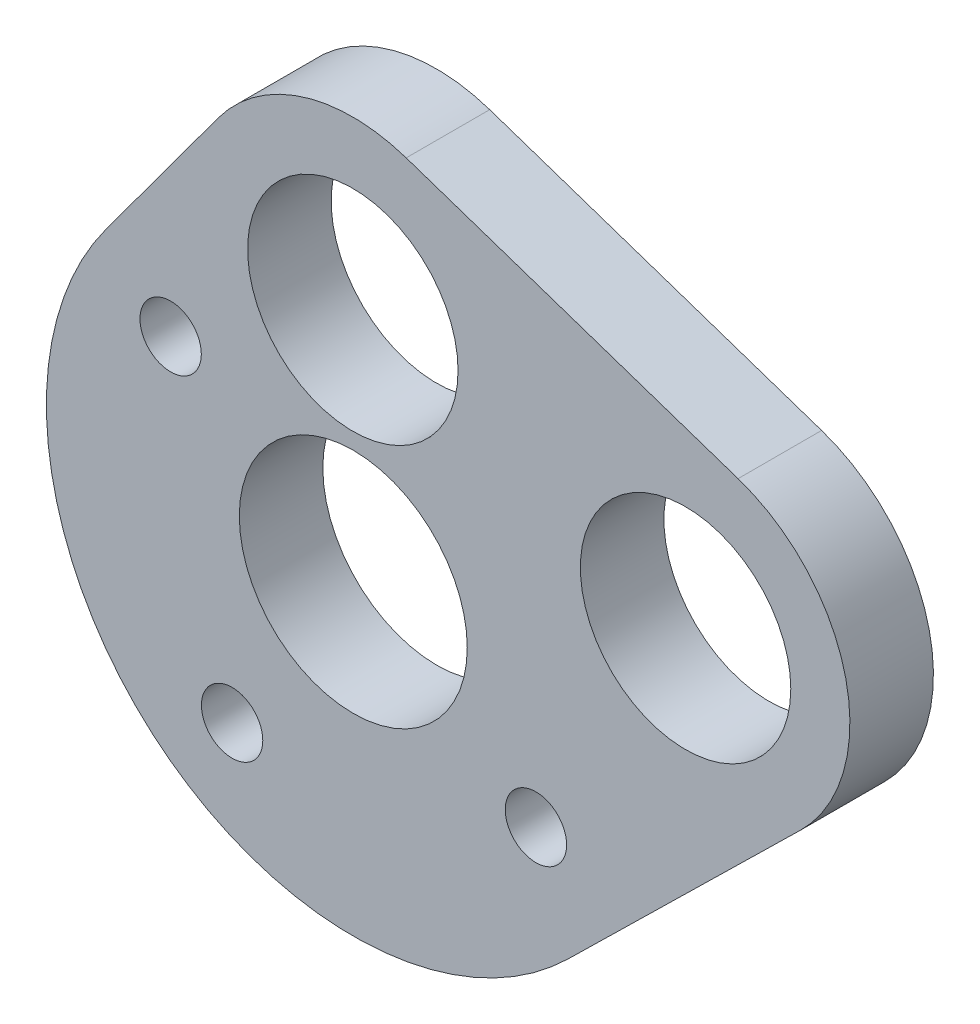
ISO-10303-21;
HEADER;
FILE_DESCRIPTION(('STEP AP214'),'2;1');
FILE_NAME('part.step','',(''),(''),'','','');
FILE_SCHEMA(('AUTOMOTIVE_DESIGN { 1 0 10303 214 1 1 1 1 }'));
ENDSEC;
DATA;
#1=APPLICATION_CONTEXT('core data for automotive mechanical design processes');
#2=APPLICATION_PROTOCOL_DEFINITION('international standard','automotive_design',2000,#1);
#3=PRODUCT_CONTEXT('',#1,'mechanical');
#4=PRODUCT('Part','Part','',(#3));
#5=PRODUCT_RELATED_PRODUCT_CATEGORY('part','',(#4));
#6=PRODUCT_DEFINITION_FORMATION('','',#4);
#7=PRODUCT_DEFINITION_CONTEXT('part definition',#1,'design');
#8=PRODUCT_DEFINITION('design','',#6,#7);
#9=PRODUCT_DEFINITION_SHAPE('','',#8);
#10=(LENGTH_UNIT() NAMED_UNIT(*) SI_UNIT(.MILLI.,.METRE.));
#11=(NAMED_UNIT(*) PLANE_ANGLE_UNIT() SI_UNIT($,.RADIAN.));
#12=(NAMED_UNIT(*) SI_UNIT($,.STERADIAN.) SOLID_ANGLE_UNIT());
#13=UNCERTAINTY_MEASURE_WITH_UNIT(LENGTH_MEASURE(1.E-05),#10,'distance_accuracy_value','');
#14=(GEOMETRIC_REPRESENTATION_CONTEXT(3) GLOBAL_UNCERTAINTY_ASSIGNED_CONTEXT((#13)) GLOBAL_UNIT_ASSIGNED_CONTEXT((#10,
#11,#12)) REPRESENTATION_CONTEXT('',''));
#15=CARTESIAN_POINT('',(0.,0.,0.));
#16=DIRECTION('',(0.,0.,1.));
#17=DIRECTION('',(1.,0.,0.));
#18=AXIS2_PLACEMENT_3D('',#15,#16,#17);
#19=CARTESIAN_POINT('',(18.9494835234297,6.59271288329673,4.7625));
#20=DIRECTION('',(0.,0.,1.));
#21=DIRECTION('',(1.,0.,0.));
#22=AXIS2_PLACEMENT_3D('',#19,#20,#21);
#23=PLANE('',#22);
#24=CARTESIAN_POINT('',(-6.91074020477706,-11.0104698412655,4.7625));
#25=DIRECTION('',(0.,0.,1.));
#26=DIRECTION('',(1.,0.,0.));
#27=AXIS2_PLACEMENT_3D('',#24,#25,#26);
#28=CIRCLE('',#27,1.75000000000055);
#29=CARTESIAN_POINT('',(-5.16074020477651,-11.0104698412655,4.7625));
#30=VERTEX_POINT('',#29);
#31=EDGE_CURVE('E201',#30,#30,#28,.T.);
#32=ORIENTED_EDGE('',*,*,#31,.F.);
#33=EDGE_LOOP('',(#32));
#34=FACE_BOUND('',#33,.T.);
#35=CARTESIAN_POINT('',(0.,-0.594536382276894,4.7625));
#36=DIRECTION('',(0.,0.,1.));
#37=DIRECTION('',(1.,0.,0.));
#38=AXIS2_PLACEMENT_3D('',#35,#36,#37);
#39=CIRCLE('',#38,6.5);
#40=CARTESIAN_POINT('',(6.50000000000004,-0.594536382276894,4.7625));
#41=VERTEX_POINT('',#40);
#42=EDGE_CURVE('E214',#41,#41,#39,.T.);
#43=ORIENTED_EDGE('',*,*,#42,.F.);
#44=EDGE_LOOP('',(#43));
#45=FACE_BOUND('',#44,.T.);
#46=CARTESIAN_POINT('',(-0.025118945589,12.827,4.7625));
#47=DIRECTION('',(0.,0.,1.));
#48=DIRECTION('',(1.,0.,0.));
#49=AXIS2_PLACEMENT_3D('',#46,#47,#48);
#50=CIRCLE('',#49,6.);
#51=CARTESIAN_POINT('',(5.974881054411,12.827,4.7625));
#52=VERTEX_POINT('',#51);
#53=EDGE_CURVE('E126',#52,#52,#50,.T.);
#54=ORIENTED_EDGE('',*,*,#53,.F.);
#55=EDGE_LOOP('',(#54));
#56=FACE_BOUND('',#55,.T.);
#57=CARTESIAN_POINT('',(18.9494835234297,6.59271288329673,4.7625));
#58=DIRECTION('',(0.,0.,1.));
#59=DIRECTION('',(1.,0.,0.));
#60=AXIS2_PLACEMENT_3D('',#57,#58,#59);
#61=CIRCLE('',#60,9.37193516949339);
#62=CARTESIAN_POINT('',(25.5084496323001,-0.101548271145753,4.7625));
#63=VERTEX_POINT('',#62);
#64=CARTESIAN_POINT('',(21.9430183012189,15.4736992224008,4.7625));
#65=VERTEX_POINT('',#64);
#66=EDGE_CURVE('E134',#63,#65,#61,.T.);
#67=ORIENTED_EDGE('',*,*,#66,.T.);
#68=DIRECTION('',(-0.947614999302666,0.319414797867301,0.));
#69=VECTOR('',#68,1.);
#70=CARTESIAN_POINT('',(3.01730700409704,21.8530328683579,4.7625));
#71=LINE('',#70,#69);
#72=CARTESIAN_POINT('',(3.01730700409704,21.8530328683579,4.7625));
#73=VERTEX_POINT('',#72);
#74=EDGE_CURVE('E93',#65,#73,#71,.T.);
#75=ORIENTED_EDGE('',*,*,#74,.T.);
#76=CARTESIAN_POINT('',(-0.025118945589,12.827,4.7625));
#77=DIRECTION('',(0.,0.,1.));
#78=DIRECTION('',(1.,0.,0.));
#79=AXIS2_PLACEMENT_3D('',#76,#77,#78);
#80=CIRCLE('',#79,9.525);
#81=CARTESIAN_POINT('',(-7.69686802258871,18.4723424253586,4.7625));
#82=VERTEX_POINT('',#81);
#83=EDGE_CURVE('E107',#73,#82,#80,.T.);
#84=ORIENTED_EDGE('',*,*,#83,.T.);
#85=DIRECTION('',(-0.592686868804055,-0.805432973963225,0.));
#86=VECTOR('',#85,1.);
#87=CARTESIAN_POINT('',(-14.0950770443564,9.77748382179407,4.7625));
#88=LINE('',#87,#86);
#89=CARTESIAN_POINT('',(-14.0950770443564,9.77748382179407,4.7625));
#90=VERTEX_POINT('',#89);
#91=EDGE_CURVE('E99',#82,#90,#88,.T.);
#92=ORIENTED_EDGE('',*,*,#91,.T.);
#93=CARTESIAN_POINT('',(0.,-0.594536382276894,4.7625));
#94=DIRECTION('',(0.,0.,1.));
#95=DIRECTION('',(1.,0.,0.));
#96=AXIS2_PLACEMENT_3D('',#93,#94,#95);
#97=CIRCLE('',#96,17.5);
#98=CARTESIAN_POINT('',(12.2474072674828,-13.0945769911873,4.7625));
#99=VERTEX_POINT('',#98);
#100=EDGE_CURVE('E101',#90,#99,#97,.T.);
#101=ORIENTED_EDGE('',*,*,#100,.T.);
#102=DIRECTION('',(0.714288034794883,0.699851843856158,0.));
#103=VECTOR('',#102,1.);
#104=CARTESIAN_POINT('',(25.5084496323001,-0.101548271145753,4.7625));
#105=LINE('',#104,#103);
#106=EDGE_CURVE('E57',#99,#63,#105,.T.);
#107=ORIENTED_EDGE('',*,*,#106,.T.);
#108=EDGE_LOOP('',(#67,#75,#84,#92,#101,#107));
#109=FACE_BOUND('',#108,.T.);
#110=CARTESIAN_POINT('',(18.9494835234297,6.59271288329673,4.7625));
#111=DIRECTION('',(0.,0.,1.));
#112=DIRECTION('',(1.,0.,0.));
#113=AXIS2_PLACEMENT_3D('',#110,#111,#112);
#114=CIRCLE('',#113,6.);
#115=CARTESIAN_POINT('',(24.9494835234297,6.59271288329673,4.7625));
#116=VERTEX_POINT('',#115);
#117=EDGE_CURVE('E221',#116,#116,#114,.T.);
#118=ORIENTED_EDGE('',*,*,#117,.F.);
#119=EDGE_LOOP('',(#118));
#120=FACE_BOUND('',#119,.T.);
#121=CARTESIAN_POINT('',(-10.415933458988,6.31620382250098,4.7625));
#122=DIRECTION('',(0.,0.,1.));
#123=DIRECTION('',(1.,0.,0.));
#124=AXIS2_PLACEMENT_3D('',#121,#122,#123);
#125=CIRCLE('',#124,1.75);
#126=CARTESIAN_POINT('',(-8.66593345898801,6.31620382250098,4.7625));
#127=VERTEX_POINT('',#126);
#128=EDGE_CURVE('E209',#127,#127,#125,.T.);
#129=ORIENTED_EDGE('',*,*,#128,.F.);
#130=EDGE_LOOP('',(#129));
#131=FACE_BOUND('',#130,.T.);
#132=CARTESIAN_POINT('',(10.4159334589891,-7.50527658705324,4.7625));
#133=DIRECTION('',(0.,0.,1.));
#134=DIRECTION('',(1.,0.,0.));
#135=AXIS2_PLACEMENT_3D('',#132,#133,#134);
#136=CIRCLE('',#135,1.75);
#137=CARTESIAN_POINT('',(12.1659334589891,-7.50527658705324,4.7625));
#138=VERTEX_POINT('',#137);
#139=EDGE_CURVE('E191',#138,#138,#136,.T.);
#140=ORIENTED_EDGE('',*,*,#139,.F.);
#141=EDGE_LOOP('',(#140));
#142=FACE_BOUND('',#141,.T.);
#143=ADVANCED_FACE('F39',(#34,#45,#56,#109,#120,#131,#142),#23,.T.);
#144=CARTESIAN_POINT('',(18.9494835234297,6.59271288329673,0.));
#145=DIRECTION('',(0.,0.,1.));
#146=DIRECTION('',(1.,0.,0.));
#147=AXIS2_PLACEMENT_3D('',#144,#145,#146);
#148=PLANE('',#147);
#149=CARTESIAN_POINT('',(18.9494835234297,6.59271288329673,0.));
#150=DIRECTION('',(0.,0.,1.));
#151=DIRECTION('',(1.,0.,0.));
#152=AXIS2_PLACEMENT_3D('',#149,#150,#151);
#153=CIRCLE('',#152,9.37193516949339);
#154=CARTESIAN_POINT('',(25.5084496323001,-0.101548271145753,0.));
#155=VERTEX_POINT('',#154);
#156=CARTESIAN_POINT('',(21.9430183012189,15.4736992224008,0.));
#157=VERTEX_POINT('',#156);
#158=EDGE_CURVE('E125',#155,#157,#153,.T.);
#159=ORIENTED_EDGE('',*,*,#158,.F.);
#160=DIRECTION('',(0.714288034794883,0.699851843856158,0.));
#161=VECTOR('',#160,1.);
#162=CARTESIAN_POINT('',(25.5084496323001,-0.101548271145753,0.));
#163=LINE('',#162,#161);
#164=CARTESIAN_POINT('',(12.2474072674828,-13.0945769911873,0.));
#165=VERTEX_POINT('',#164);
#166=EDGE_CURVE('E82',#165,#155,#163,.T.);
#167=ORIENTED_EDGE('',*,*,#166,.F.);
#168=CARTESIAN_POINT('',(0.,-0.594536382276894,0.));
#169=DIRECTION('',(0.,0.,1.));
#170=DIRECTION('',(1.,0.,0.));
#171=AXIS2_PLACEMENT_3D('',#168,#169,#170);
#172=CIRCLE('',#171,17.5);
#173=CARTESIAN_POINT('',(-14.0950770443564,9.77748382179407,0.));
#174=VERTEX_POINT('',#173);
#175=EDGE_CURVE('E80',#174,#165,#172,.T.);
#176=ORIENTED_EDGE('',*,*,#175,.F.);
#177=DIRECTION('',(-0.592686868804055,-0.805432973963225,0.));
#178=VECTOR('',#177,1.);
#179=CARTESIAN_POINT('',(-14.0950770443564,9.77748382179407,0.));
#180=LINE('',#179,#178);
#181=CARTESIAN_POINT('',(-7.69686802258871,18.4723424253586,0.));
#182=VERTEX_POINT('',#181);
#183=EDGE_CURVE('E114',#182,#174,#180,.T.);
#184=ORIENTED_EDGE('',*,*,#183,.F.);
#185=CARTESIAN_POINT('',(-0.025118945589,12.827,0.));
#186=DIRECTION('',(0.,0.,1.));
#187=DIRECTION('',(1.,0.,0.));
#188=AXIS2_PLACEMENT_3D('',#185,#186,#187);
#189=CIRCLE('',#188,9.525);
#190=CARTESIAN_POINT('',(3.01730700409704,21.8530328683579,0.));
#191=VERTEX_POINT('',#190);
#192=EDGE_CURVE('E127',#191,#182,#189,.T.);
#193=ORIENTED_EDGE('',*,*,#192,.F.);
#194=DIRECTION('',(-0.947614999302666,0.319414797867301,0.));
#195=VECTOR('',#194,1.);
#196=CARTESIAN_POINT('',(3.01730700409704,21.8530328683579,0.));
#197=LINE('',#196,#195);
#198=EDGE_CURVE('E130',#157,#191,#197,.T.);
#199=ORIENTED_EDGE('',*,*,#198,.F.);
#200=EDGE_LOOP('',(#159,#167,#176,#184,#193,#199));
#201=FACE_BOUND('',#200,.T.);
#202=CARTESIAN_POINT('',(-0.025118945589,12.827,0.));
#203=DIRECTION('',(0.,0.,1.));
#204=DIRECTION('',(1.,0.,0.));
#205=AXIS2_PLACEMENT_3D('',#202,#203,#204);
#206=CIRCLE('',#205,6.);
#207=CARTESIAN_POINT('',(5.974881054411,12.827,0.));
#208=VERTEX_POINT('',#207);
#209=EDGE_CURVE('E222',#208,#208,#206,.T.);
#210=ORIENTED_EDGE('',*,*,#209,.T.);
#211=EDGE_LOOP('',(#210));
#212=FACE_BOUND('',#211,.T.);
#213=CARTESIAN_POINT('',(18.9494835234297,6.59271288329673,0.));
#214=DIRECTION('',(0.,0.,1.));
#215=DIRECTION('',(1.,0.,0.));
#216=AXIS2_PLACEMENT_3D('',#213,#214,#215);
#217=CIRCLE('',#216,6.);
#218=CARTESIAN_POINT('',(24.9494835234297,6.59271288329673,0.));
#219=VERTEX_POINT('',#218);
#220=EDGE_CURVE('E216',#219,#219,#217,.T.);
#221=ORIENTED_EDGE('',*,*,#220,.T.);
#222=EDGE_LOOP('',(#221));
#223=FACE_BOUND('',#222,.T.);
#224=CARTESIAN_POINT('',(0.,-0.594536382276894,0.));
#225=DIRECTION('',(0.,0.,1.));
#226=DIRECTION('',(1.,0.,0.));
#227=AXIS2_PLACEMENT_3D('',#224,#225,#226);
#228=CIRCLE('',#227,6.5);
#229=CARTESIAN_POINT('',(6.50000000000004,-0.594536382276894,0.));
#230=VERTEX_POINT('',#229);
#231=EDGE_CURVE('E212',#230,#230,#228,.T.);
#232=ORIENTED_EDGE('',*,*,#231,.T.);
#233=EDGE_LOOP('',(#232));
#234=FACE_BOUND('',#233,.T.);
#235=CARTESIAN_POINT('',(-10.415933458988,6.31620382250098,0.));
#236=DIRECTION('',(0.,0.,1.));
#237=DIRECTION('',(1.,0.,0.));
#238=AXIS2_PLACEMENT_3D('',#235,#236,#237);
#239=CIRCLE('',#238,1.75);
#240=CARTESIAN_POINT('',(-8.66593345898801,6.31620382250098,0.));
#241=VERTEX_POINT('',#240);
#242=EDGE_CURVE('E207',#241,#241,#239,.T.);
#243=ORIENTED_EDGE('',*,*,#242,.T.);
#244=EDGE_LOOP('',(#243));
#245=FACE_BOUND('',#244,.T.);
#246=CARTESIAN_POINT('',(-6.91074020477706,-11.0104698412655,0.));
#247=DIRECTION('',(0.,0.,1.));
#248=DIRECTION('',(1.,0.,0.));
#249=AXIS2_PLACEMENT_3D('',#246,#247,#248);
#250=CIRCLE('',#249,1.75000000000055);
#251=CARTESIAN_POINT('',(-5.16074020477651,-11.0104698412655,0.));
#252=VERTEX_POINT('',#251);
#253=EDGE_CURVE('E196',#252,#252,#250,.T.);
#254=ORIENTED_EDGE('',*,*,#253,.T.);
#255=EDGE_LOOP('',(#254));
#256=FACE_BOUND('',#255,.T.);
#257=CARTESIAN_POINT('',(10.4159334589891,-7.50527658705324,0.));
#258=DIRECTION('',(0.,0.,1.));
#259=DIRECTION('',(1.,0.,0.));
#260=AXIS2_PLACEMENT_3D('',#257,#258,#259);
#261=CIRCLE('',#260,1.75);
#262=CARTESIAN_POINT('',(12.1659334589891,-7.50527658705324,0.));
#263=VERTEX_POINT('',#262);
#264=EDGE_CURVE('E200',#263,#263,#261,.T.);
#265=ORIENTED_EDGE('',*,*,#264,.T.);
#266=EDGE_LOOP('',(#265));
#267=FACE_BOUND('',#266,.T.);
#268=ADVANCED_FACE('F143',(#201,#212,#223,#234,#245,#256,#267),#148,.F.);
#269=CARTESIAN_POINT('',(18.9494835234297,6.59271288329673,4.7625));
#270=DIRECTION('',(0.,0.,-1.));
#271=DIRECTION('',(-1.,0.,0.));
#272=AXIS2_PLACEMENT_3D('',#269,#270,#271);
#273=CYLINDRICAL_SURFACE('',#272,9.37193516949339);
#274=ORIENTED_EDGE('',*,*,#158,.T.);
#275=DIRECTION('',(0.,0.,-1.));
#276=VECTOR('',#275,1.);
#277=CARTESIAN_POINT('',(21.9430183012189,15.4736992224008,4.7625));
#278=LINE('',#277,#276);
#279=EDGE_CURVE('E11',#65,#157,#278,.T.);
#280=ORIENTED_EDGE('',*,*,#279,.F.);
#281=ORIENTED_EDGE('',*,*,#66,.F.);
#282=DIRECTION('',(0.,0.,-1.));
#283=VECTOR('',#282,1.);
#284=CARTESIAN_POINT('',(25.5084496323001,-0.101548271145753,4.7625));
#285=LINE('',#284,#283);
#286=EDGE_CURVE('E116',#63,#155,#285,.T.);
#287=ORIENTED_EDGE('',*,*,#286,.T.);
#288=EDGE_LOOP('',(#274,#280,#281,#287));
#289=FACE_BOUND('',#288,.T.);
#290=ADVANCED_FACE('F41',(#289),#273,.T.);
#291=CARTESIAN_POINT('',(3.01730700409704,21.8530328683579,4.7625));
#292=DIRECTION('',(-0.319414797867301,-0.947614999302666,0.));
#293=DIRECTION('',(0.947614999302666,-0.319414797867301,0.));
#294=AXIS2_PLACEMENT_3D('',#291,#292,#293);
#295=PLANE('',#294);
#296=ORIENTED_EDGE('',*,*,#198,.T.);
#297=DIRECTION('',(0.,0.,-1.));
#298=VECTOR('',#297,1.);
#299=CARTESIAN_POINT('',(3.01730700409704,21.8530328683579,4.7625));
#300=LINE('',#299,#298);
#301=EDGE_CURVE('E48',#73,#191,#300,.T.);
#302=ORIENTED_EDGE('',*,*,#301,.F.);
#303=ORIENTED_EDGE('',*,*,#74,.F.);
#304=ORIENTED_EDGE('',*,*,#279,.T.);
#305=EDGE_LOOP('',(#296,#302,#303,#304));
#306=FACE_BOUND('',#305,.T.);
#307=ADVANCED_FACE('F308',(#306),#295,.F.);
#308=CARTESIAN_POINT('',(-0.025118945589,12.827,4.7625));
#309=DIRECTION('',(0.,0.,-1.));
#310=DIRECTION('',(-1.,0.,0.));
#311=AXIS2_PLACEMENT_3D('',#308,#309,#310);
#312=CYLINDRICAL_SURFACE('',#311,9.525);
#313=ORIENTED_EDGE('',*,*,#192,.T.);
#314=DIRECTION('',(0.,0.,-1.));
#315=VECTOR('',#314,1.);
#316=CARTESIAN_POINT('',(-7.69686802258871,18.4723424253586,4.7625));
#317=LINE('',#316,#315);
#318=EDGE_CURVE('E113',#82,#182,#317,.T.);
#319=ORIENTED_EDGE('',*,*,#318,.F.);
#320=ORIENTED_EDGE('',*,*,#83,.F.);
#321=ORIENTED_EDGE('',*,*,#301,.T.);
#322=EDGE_LOOP('',(#313,#319,#320,#321));
#323=FACE_BOUND('',#322,.T.);
#324=ADVANCED_FACE('F141',(#323),#312,.T.);
#325=CARTESIAN_POINT('',(-14.0950770443564,9.77748382179407,4.7625));
#326=DIRECTION('',(0.805432973963225,-0.592686868804055,0.));
#327=DIRECTION('',(0.592686868804055,0.805432973963225,0.));
#328=AXIS2_PLACEMENT_3D('',#325,#326,#327);
#329=PLANE('',#328);
#330=ORIENTED_EDGE('',*,*,#183,.T.);
#331=DIRECTION('',(0.,0.,-1.));
#332=VECTOR('',#331,1.);
#333=CARTESIAN_POINT('',(-14.0950770443564,9.77748382179407,4.7625));
#334=LINE('',#333,#332);
#335=EDGE_CURVE('E112',#90,#174,#334,.T.);
#336=ORIENTED_EDGE('',*,*,#335,.F.);
#337=ORIENTED_EDGE('',*,*,#91,.F.);
#338=ORIENTED_EDGE('',*,*,#318,.T.);
#339=EDGE_LOOP('',(#330,#336,#337,#338));
#340=FACE_BOUND('',#339,.T.);
#341=ADVANCED_FACE('F115',(#340),#329,.F.);
#342=CARTESIAN_POINT('',(0.,-0.594536382276894,4.7625));
#343=DIRECTION('',(0.,0.,-1.));
#344=DIRECTION('',(-1.,0.,0.));
#345=AXIS2_PLACEMENT_3D('',#342,#343,#344);
#346=CYLINDRICAL_SURFACE('',#345,17.5);
#347=ORIENTED_EDGE('',*,*,#175,.T.);
#348=DIRECTION('',(0.,0.,-1.));
#349=VECTOR('',#348,1.);
#350=CARTESIAN_POINT('',(12.2474072674828,-13.0945769911873,4.7625));
#351=LINE('',#350,#349);
#352=EDGE_CURVE('E117',#99,#165,#351,.T.);
#353=ORIENTED_EDGE('',*,*,#352,.F.);
#354=ORIENTED_EDGE('',*,*,#100,.F.);
#355=ORIENTED_EDGE('',*,*,#335,.T.);
#356=EDGE_LOOP('',(#347,#353,#354,#355));
#357=FACE_BOUND('',#356,.T.);
#358=ADVANCED_FACE('F118',(#357),#346,.T.);
#359=CARTESIAN_POINT('',(25.5084496323001,-0.101548271145753,4.7625));
#360=DIRECTION('',(-0.699851843856158,0.714288034794883,0.));
#361=DIRECTION('',(-0.714288034794883,-0.699851843856158,0.));
#362=AXIS2_PLACEMENT_3D('',#359,#360,#361);
#363=PLANE('',#362);
#364=ORIENTED_EDGE('',*,*,#166,.T.);
#365=ORIENTED_EDGE('',*,*,#286,.F.);
#366=ORIENTED_EDGE('',*,*,#106,.F.);
#367=ORIENTED_EDGE('',*,*,#352,.T.);
#368=EDGE_LOOP('',(#364,#365,#366,#367));
#369=FACE_BOUND('',#368,.T.);
#370=ADVANCED_FACE('F146',(#369),#363,.F.);
#371=CARTESIAN_POINT('',(-0.025118945589,12.827,4.7625));
#372=DIRECTION('',(0.,0.,-1.));
#373=DIRECTION('',(-1.,0.,0.));
#374=AXIS2_PLACEMENT_3D('',#371,#372,#373);
#375=CYLINDRICAL_SURFACE('',#374,6.);
#376=ORIENTED_EDGE('',*,*,#53,.T.);
#377=EDGE_LOOP('',(#376));
#378=FACE_BOUND('',#377,.T.);
#379=ORIENTED_EDGE('',*,*,#209,.F.);
#380=EDGE_LOOP('',(#379));
#381=FACE_BOUND('',#380,.T.);
#382=ADVANCED_FACE('F152',(#378,#381),#375,.F.);
#383=CARTESIAN_POINT('',(18.9494835234297,6.59271288329673,4.7625));
#384=DIRECTION('',(0.,0.,-1.));
#385=DIRECTION('',(-1.,0.,0.));
#386=AXIS2_PLACEMENT_3D('',#383,#384,#385);
#387=CYLINDRICAL_SURFACE('',#386,6.);
#388=ORIENTED_EDGE('',*,*,#117,.T.);
#389=EDGE_LOOP('',(#388));
#390=FACE_BOUND('',#389,.T.);
#391=ORIENTED_EDGE('',*,*,#220,.F.);
#392=EDGE_LOOP('',(#391));
#393=FACE_BOUND('',#392,.T.);
#394=ADVANCED_FACE('F160',(#390,#393),#387,.F.);
#395=CARTESIAN_POINT('',(0.,-0.594536382276894,4.7625));
#396=DIRECTION('',(0.,0.,-1.));
#397=DIRECTION('',(-1.,0.,0.));
#398=AXIS2_PLACEMENT_3D('',#395,#396,#397);
#399=CYLINDRICAL_SURFACE('',#398,6.5);
#400=ORIENTED_EDGE('',*,*,#42,.T.);
#401=EDGE_LOOP('',(#400));
#402=FACE_BOUND('',#401,.T.);
#403=ORIENTED_EDGE('',*,*,#231,.F.);
#404=EDGE_LOOP('',(#403));
#405=FACE_BOUND('',#404,.T.);
#406=ADVANCED_FACE('F171',(#402,#405),#399,.F.);
#407=CARTESIAN_POINT('',(-10.415933458988,6.31620382250098,4.7625));
#408=DIRECTION('',(0.,0.,-1.));
#409=DIRECTION('',(-1.,0.,0.));
#410=AXIS2_PLACEMENT_3D('',#407,#408,#409);
#411=CYLINDRICAL_SURFACE('',#410,1.75);
#412=ORIENTED_EDGE('',*,*,#128,.T.);
#413=EDGE_LOOP('',(#412));
#414=FACE_BOUND('',#413,.T.);
#415=ORIENTED_EDGE('',*,*,#242,.F.);
#416=EDGE_LOOP('',(#415));
#417=FACE_BOUND('',#416,.T.);
#418=ADVANCED_FACE('F180',(#414,#417),#411,.F.);
#419=CARTESIAN_POINT('',(-6.91074020477706,-11.0104698412655,4.7625));
#420=DIRECTION('',(0.,0.,-1.));
#421=DIRECTION('',(-1.,0.,0.));
#422=AXIS2_PLACEMENT_3D('',#419,#420,#421);
#423=CYLINDRICAL_SURFACE('',#422,1.75000000000055);
#424=ORIENTED_EDGE('',*,*,#31,.T.);
#425=EDGE_LOOP('',(#424));
#426=FACE_BOUND('',#425,.T.);
#427=ORIENTED_EDGE('',*,*,#253,.F.);
#428=EDGE_LOOP('',(#427));
#429=FACE_BOUND('',#428,.T.);
#430=ADVANCED_FACE('F181',(#426,#429),#423,.F.);
#431=CARTESIAN_POINT('',(10.4159334589891,-7.50527658705324,4.7625));
#432=DIRECTION('',(0.,0.,-1.));
#433=DIRECTION('',(-1.,0.,0.));
#434=AXIS2_PLACEMENT_3D('',#431,#432,#433);
#435=CYLINDRICAL_SURFACE('',#434,1.75);
#436=ORIENTED_EDGE('',*,*,#139,.T.);
#437=EDGE_LOOP('',(#436));
#438=FACE_BOUND('',#437,.T.);
#439=ORIENTED_EDGE('',*,*,#264,.F.);
#440=EDGE_LOOP('',(#439));
#441=FACE_BOUND('',#440,.T.);
#442=ADVANCED_FACE('F184',(#438,#441),#435,.F.);
#443=CLOSED_SHELL('',(#143,#268,#290,#307,#324,#341,#358,#370,#382,#394,#406,#418,#430,#442));
#444=MANIFOLD_SOLID_BREP('B2',#443);
#445=ADVANCED_BREP_SHAPE_REPRESENTATION('',(#18,#444),#14);
#446=SHAPE_DEFINITION_REPRESENTATION(#9,#445);
ENDSEC;
END-ISO-10303-21;
